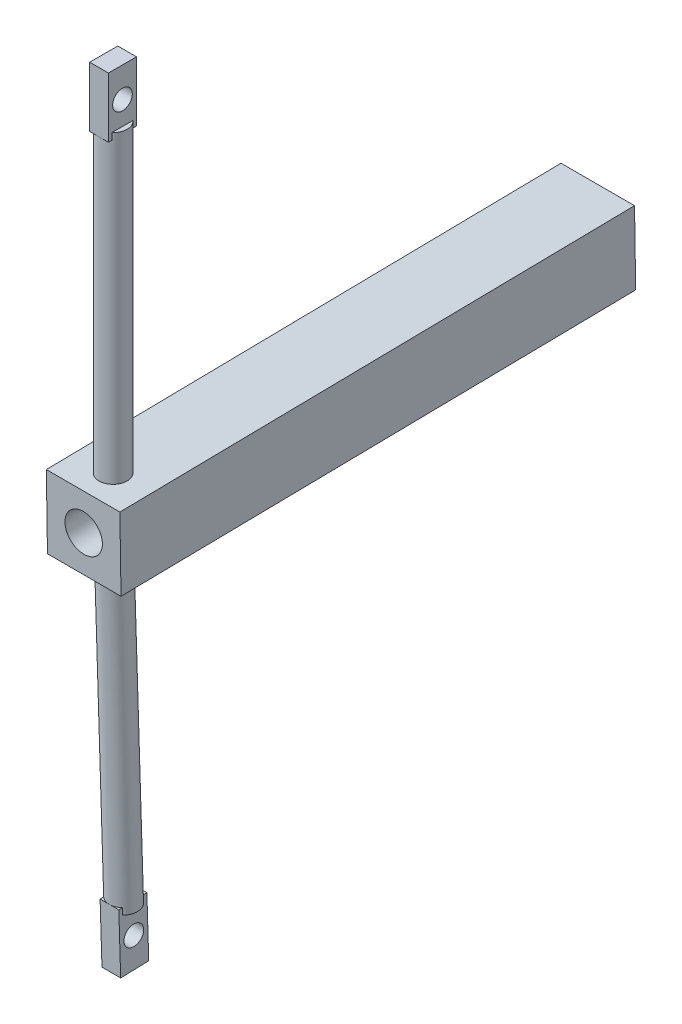
ISO-10303-21;
HEADER;
FILE_DESCRIPTION(('STEP AP214'),'2;1');
FILE_NAME('part.step','',(''),(''),'','','');
FILE_SCHEMA(('AUTOMOTIVE_DESIGN { 1 0 10303 214 1 1 1 1 }'));
ENDSEC;
DATA;
#1=APPLICATION_CONTEXT('core data for automotive mechanical design processes');
#2=APPLICATION_PROTOCOL_DEFINITION('international standard','automotive_design',2000,#1);
#3=PRODUCT_CONTEXT('',#1,'mechanical');
#4=PRODUCT('Part','Part','',(#3));
#5=PRODUCT_RELATED_PRODUCT_CATEGORY('part','',(#4));
#6=PRODUCT_DEFINITION_FORMATION('','',#4);
#7=PRODUCT_DEFINITION_CONTEXT('part definition',#1,'design');
#8=PRODUCT_DEFINITION('design','',#6,#7);
#9=PRODUCT_DEFINITION_SHAPE('','',#8);
#10=(LENGTH_UNIT() NAMED_UNIT(*) SI_UNIT(.MILLI.,.METRE.));
#11=(NAMED_UNIT(*) PLANE_ANGLE_UNIT() SI_UNIT($,.RADIAN.));
#12=(NAMED_UNIT(*) SI_UNIT($,.STERADIAN.) SOLID_ANGLE_UNIT());
#13=UNCERTAINTY_MEASURE_WITH_UNIT(LENGTH_MEASURE(1.E-05),#10,'distance_accuracy_value','');
#14=(GEOMETRIC_REPRESENTATION_CONTEXT(3) GLOBAL_UNCERTAINTY_ASSIGNED_CONTEXT((#13)) GLOBAL_UNIT_ASSIGNED_CONTEXT((#10,
#11,#12)) REPRESENTATION_CONTEXT('',''));
#15=CARTESIAN_POINT('',(0.,0.,0.));
#16=DIRECTION('',(0.,0.,1.));
#17=DIRECTION('',(1.,0.,0.));
#18=AXIS2_PLACEMENT_3D('',#15,#16,#17);
#19=CARTESIAN_POINT('',(-23373.046987515,33277.3926727913,41772.9381892933));
#20=DIRECTION('',(0.,0.999519324513116,0.0310019342113486));
#21=DIRECTION('',(0.,0.0310019342113486,-0.999519324513116));
#22=AXIS2_PLACEMENT_3D('',#19,#20,#21);
#23=PLANE('',#22);
#24=DIRECTION('',(0.,-0.0310019342113486,0.999519324513116));
#25=VECTOR('',#24,1.);
#26=CARTESIAN_POINT('',(-23363.0469875194,33277.3926727913,41772.9381892933));
#27=LINE('',#26,#25);
#28=CARTESIAN_POINT('',(-23363.0469875194,33277.7392849531,41761.7632235172));
#29=VERTEX_POINT('',#28);
#30=CARTESIAN_POINT('',(-23363.0469875194,33277.0460606296,41784.1131550695));
#31=VERTEX_POINT('',#30);
#32=EDGE_CURVE('E268',#29,#31,#27,.T.);
#33=ORIENTED_EDGE('',*,*,#32,.F.);
#34=CARTESIAN_POINT('',(-23373.046987515,33277.3926727913,41772.9381892933));
#35=DIRECTION('',(0.,-0.999519324513116,-0.0310019342113486));
#36=DIRECTION('',(0.,0.0310019342113486,-0.999519324513116));
#37=AXIS2_PLACEMENT_3D('',#34,#35,#36);
#38=CIRCLE('',#37,15.0000000000006);
#39=EDGE_CURVE('E271',#31,#29,#38,.F.);
#40=ORIENTED_EDGE('',*,*,#39,.F.);
#41=EDGE_LOOP('',(#33,#40));
#42=FACE_BOUND('',#41,.T.);
#43=ADVANCED_FACE('F49',(#42),#23,.F.);
#44=CARTESIAN_POINT('',(-23373.046987515,33277.3926727913,41772.9381892933));
#45=DIRECTION('',(0.,0.999519324513116,0.0310019342113486));
#46=DIRECTION('',(0.,-0.0310019342113486,0.999519324513116));
#47=AXIS2_PLACEMENT_3D('',#44,#45,#46);
#48=CYLINDRICAL_SURFACE('',#47,15.0000000000006);
#49=CARTESIAN_POINT('',(-23373.046987515,33602.7741051068,41783.0304941751));
#50=DIRECTION('',(0.,-0.999519324513116,-0.0310019342113486));
#51=DIRECTION('',(0.,0.0310019342113486,-0.999519324513116));
#52=AXIS2_PLACEMENT_3D('',#49,#50,#51);
#53=CIRCLE('',#52,15.0000000000006);
#54=CARTESIAN_POINT('',(-23388.046987515,33602.7741051068,41783.0304941779));
#55=VERTEX_POINT('',#54);
#56=CARTESIAN_POINT('',(-23358.046987515,33602.7741051068,41783.0304941779));
#57=VERTEX_POINT('',#56);
#58=EDGE_CURVE('E274',#55,#57,#53,.F.);
#59=ORIENTED_EDGE('',*,*,#58,.F.);
#60=CARTESIAN_POINT('',(-23373.046987515,33602.7741051068,41783.0304941751));
#61=DIRECTION('',(0.,-0.999879823907132,-0.0155028301752332));
#62=DIRECTION('',(0.,-0.0155028301752332,0.999879823907132));
#63=AXIS2_PLACEMENT_3D('',#60,#61,#62);
#64=ELLIPSE('',#63,15.001802858054,15.0000000000006);
#65=EDGE_CURVE('E393',#55,#57,#64,.T.);
#66=ORIENTED_EDGE('',*,*,#65,.T.);
#67=EDGE_LOOP('',(#59,#66));
#68=FACE_BOUND('',#67,.T.);
#69=CARTESIAN_POINT('',(-23373.046987515,33284.426358658,41773.1563520253));
#70=DIRECTION('',(0.,-0.999519324513116,-0.0310019342113486));
#71=DIRECTION('',(0.,0.0310019342113486,-0.999519324513116));
#72=AXIS2_PLACEMENT_3D('',#69,#70,#71);
#73=CIRCLE('',#72,15.0000000000006);
#74=CARTESIAN_POINT('',(-23373.046987515,33283.9613296449,41788.149141893));
#75=VERTEX_POINT('',#74);
#76=CARTESIAN_POINT('',(-23363.0469875194,33284.0797464963,41784.3313178015));
#77=VERTEX_POINT('',#76);
#78=EDGE_CURVE('E57',#75,#77,#73,.F.);
#79=ORIENTED_EDGE('',*,*,#78,.T.);
#80=DIRECTION('',(0.,0.999519324513116,0.0310019342113486));
#81=VECTOR('',#80,1.);
#82=CARTESIAN_POINT('',(-23363.0469875194,33277.0460606296,41784.1131550695));
#83=LINE('',#82,#81);
#84=EDGE_CURVE('E12',#77,#31,#83,.F.);
#85=ORIENTED_EDGE('',*,*,#84,.T.);
#86=ORIENTED_EDGE('',*,*,#39,.T.);
#87=DIRECTION('',(0.,0.999519324513116,0.0310019342113486));
#88=VECTOR('',#87,1.);
#89=CARTESIAN_POINT('',(-23363.0469875194,33277.7392849531,41761.7632235172));
#90=LINE('',#89,#88);
#91=CARTESIAN_POINT('',(-23363.0469875194,33284.7729708198,41761.9813862492));
#92=VERTEX_POINT('',#91);
#93=EDGE_CURVE('E69',#29,#92,#90,.T.);
#94=ORIENTED_EDGE('',*,*,#93,.T.);
#95=CARTESIAN_POINT('',(-23373.046987515,33284.8913876712,41758.1635621576));
#96=VERTEX_POINT('',#95);
#97=EDGE_CURVE('E405',#92,#96,#73,.F.);
#98=ORIENTED_EDGE('',*,*,#97,.T.);
#99=CARTESIAN_POINT('',(-23383.0469875194,33284.7729708196,41761.9813862571));
#100=VERTEX_POINT('',#99);
#101=EDGE_CURVE('E402',#96,#100,#73,.F.);
#102=ORIENTED_EDGE('',*,*,#101,.T.);
#103=DIRECTION('',(0.,0.999519324513116,0.0310019342113486));
#104=VECTOR('',#103,1.);
#105=CARTESIAN_POINT('',(-23383.0469875194,33277.7392849529,41761.7632235251));
#106=LINE('',#105,#104);
#107=CARTESIAN_POINT('',(-23383.0469875194,33277.7392849529,41761.7632235251));
#108=VERTEX_POINT('',#107);
#109=EDGE_CURVE('E399',#108,#100,#106,.T.);
#110=ORIENTED_EDGE('',*,*,#109,.F.);
#111=CARTESIAN_POINT('',(-23383.0469875194,33277.0460606298,41784.1131550616));
#112=VERTEX_POINT('',#111);
#113=EDGE_CURVE('E273',#108,#112,#38,.F.);
#114=ORIENTED_EDGE('',*,*,#113,.T.);
#115=DIRECTION('',(0.,0.999519324513116,0.0310019342113486));
#116=VECTOR('',#115,1.);
#117=CARTESIAN_POINT('',(-23383.0469875194,33277.0460606298,41784.1131550616));
#118=LINE('',#117,#116);
#119=CARTESIAN_POINT('',(-23383.0469875194,33284.0797464965,41784.3313177936));
#120=VERTEX_POINT('',#119);
#121=EDGE_CURVE('E404',#120,#112,#118,.F.);
#122=ORIENTED_EDGE('',*,*,#121,.F.);
#123=EDGE_CURVE('E226',#120,#75,#73,.F.);
#124=ORIENTED_EDGE('',*,*,#123,.T.);
#125=EDGE_LOOP('',(#79,#85,#86,#94,#98,#102,#110,#114,#122,#124));
#126=FACE_BOUND('',#125,.T.);
#127=ADVANCED_FACE('F407',(#68,#126),#48,.T.);
#128=CARTESIAN_POINT('',(-23373.046987515,34006.8953400424,41784.2489045337));
#129=DIRECTION('',(0.,-1.,0.));
#130=DIRECTION('',(0.,0.,-1.));
#131=AXIS2_PLACEMENT_3D('',#128,#129,#130);
#132=PLANE('',#131);
#133=DIRECTION('',(0.,0.,-1.));
#134=VECTOR('',#133,1.);
#135=CARTESIAN_POINT('',(-23363.0469875194,34006.8953400424,41784.2489045337));
#136=LINE('',#135,#134);
#137=CARTESIAN_POINT('',(-23363.0469875194,34006.8953400424,41795.4292444251));
#138=VERTEX_POINT('',#137);
#139=CARTESIAN_POINT('',(-23363.0469875194,34006.8953400424,41773.0685646422));
#140=VERTEX_POINT('',#139);
#141=EDGE_CURVE('E323',#138,#140,#136,.T.);
#142=ORIENTED_EDGE('',*,*,#141,.F.);
#143=CARTESIAN_POINT('',(-23373.046987515,34006.8953400424,41784.2489045337));
#144=DIRECTION('',(0.,-1.,0.));
#145=DIRECTION('',(0.,0.,-1.));
#146=AXIS2_PLACEMENT_3D('',#143,#144,#145);
#147=CIRCLE('',#146,15.0000000000006);
#148=EDGE_CURVE('E329',#140,#138,#147,.T.);
#149=ORIENTED_EDGE('',*,*,#148,.F.);
#150=EDGE_LOOP('',(#142,#149));
#151=FACE_BOUND('',#150,.T.);
#152=ADVANCED_FACE('F423',(#151),#132,.F.);
#153=CARTESIAN_POINT('',(-23373.046987515,34006.8953400424,41784.2489045337));
#154=DIRECTION('',(0.,-1.,0.));
#155=DIRECTION('',(0.,0.,-1.));
#156=AXIS2_PLACEMENT_3D('',#153,#154,#155);
#157=CYLINDRICAL_SURFACE('',#156,15.0000000000006);
#158=CARTESIAN_POINT('',(-23373.046987515,33999.8582716294,41784.2489045337));
#159=DIRECTION('',(0.,-1.,0.));
#160=DIRECTION('',(1.,0.,0.));
#161=AXIS2_PLACEMENT_3D('',#158,#159,#160);
#162=CIRCLE('',#161,15.0000000000006);
#163=CARTESIAN_POINT('',(-23373.046987515,33999.8582716294,41799.2489045337));
#164=VERTEX_POINT('',#163);
#165=CARTESIAN_POINT('',(-23363.0469875194,33999.8582716294,41795.4292444251));
#166=VERTEX_POINT('',#165);
#167=EDGE_CURVE('E384',#164,#166,#162,.F.);
#168=ORIENTED_EDGE('',*,*,#167,.F.);
#169=CARTESIAN_POINT('',(-23383.0469875194,33999.8582716294,41795.4292444172));
#170=VERTEX_POINT('',#169);
#171=EDGE_CURVE('E380',#170,#164,#162,.F.);
#172=ORIENTED_EDGE('',*,*,#171,.F.);
#173=DIRECTION('',(0.,-1.,0.));
#174=VECTOR('',#173,1.);
#175=CARTESIAN_POINT('',(-23383.0469875194,34006.8953400424,41795.4292444172));
#176=LINE('',#175,#174);
#177=CARTESIAN_POINT('',(-23383.0469875194,34006.8953400424,41795.4292444172));
#178=VERTEX_POINT('',#177);
#179=EDGE_CURVE('E377',#178,#170,#176,.T.);
#180=ORIENTED_EDGE('',*,*,#179,.F.);
#181=CARTESIAN_POINT('',(-23383.0469875194,34006.8953400424,41773.0685646501));
#182=VERTEX_POINT('',#181);
#183=EDGE_CURVE('E326',#178,#182,#147,.T.);
#184=ORIENTED_EDGE('',*,*,#183,.T.);
#185=DIRECTION('',(0.,-1.,0.));
#186=VECTOR('',#185,1.);
#187=CARTESIAN_POINT('',(-23383.0469875194,34006.8953400424,41773.0685646501));
#188=LINE('',#187,#186);
#189=CARTESIAN_POINT('',(-23383.0469875194,33999.8582716294,41773.0685646501));
#190=VERTEX_POINT('',#189);
#191=EDGE_CURVE('E383',#190,#182,#188,.F.);
#192=ORIENTED_EDGE('',*,*,#191,.F.);
#193=CARTESIAN_POINT('',(-23373.046987515,33999.8582716294,41769.2489045337));
#194=VERTEX_POINT('',#193);
#195=EDGE_CURVE('E385',#194,#190,#162,.F.);
#196=ORIENTED_EDGE('',*,*,#195,.F.);
#197=CARTESIAN_POINT('',(-23363.0469875194,33999.8582716294,41773.0685646422));
#198=VERTEX_POINT('',#197);
#199=EDGE_CURVE('E391',#198,#194,#162,.F.);
#200=ORIENTED_EDGE('',*,*,#199,.F.);
#201=DIRECTION('',(0.,-1.,0.));
#202=VECTOR('',#201,1.);
#203=CARTESIAN_POINT('',(-23363.0469875194,34006.8953400424,41773.0685646422));
#204=LINE('',#203,#202);
#205=EDGE_CURVE('E388',#198,#140,#204,.F.);
#206=ORIENTED_EDGE('',*,*,#205,.T.);
#207=ORIENTED_EDGE('',*,*,#148,.T.);
#208=DIRECTION('',(0.,-1.,0.));
#209=VECTOR('',#208,1.);
#210=CARTESIAN_POINT('',(-23363.0469875194,34006.8953400424,41795.4292444251));
#211=LINE('',#210,#209);
#212=EDGE_CURVE('E390',#138,#166,#211,.T.);
#213=ORIENTED_EDGE('',*,*,#212,.T.);
#214=EDGE_LOOP('',(#168,#172,#180,#184,#192,#196,#200,#206,#207,#213));
#215=FACE_BOUND('',#214,.T.);
#216=CARTESIAN_POINT('',(-23373.046987515,33681.3574296333,41784.2489045337));
#217=DIRECTION('',(0.,-1.,0.));
#218=DIRECTION('',(0.,0.,-1.));
#219=AXIS2_PLACEMENT_3D('',#216,#217,#218);
#220=CIRCLE('',#219,15.0000000000006);
#221=CARTESIAN_POINT('',(-23358.046987515,33681.3574296333,41784.2489045318));
#222=VERTEX_POINT('',#221);
#223=CARTESIAN_POINT('',(-23388.046987515,33681.3574296333,41784.2489045318));
#224=VERTEX_POINT('',#223);
#225=EDGE_CURVE('E330',#222,#224,#220,.T.);
#226=ORIENTED_EDGE('',*,*,#225,.F.);
#227=CARTESIAN_POINT('',(-23373.046987515,33681.3574296333,41784.2489045337));
#228=DIRECTION('',(0.,0.999879823907132,0.0155028301752332));
#229=DIRECTION('',(0.,-0.0155028301752332,0.999879823907132));
#230=AXIS2_PLACEMENT_3D('',#227,#228,#229);
#231=ELLIPSE('',#230,15.001802858054,15.0000000000006);
#232=EDGE_CURVE('E366',#222,#224,#231,.T.);
#233=ORIENTED_EDGE('',*,*,#232,.T.);
#234=EDGE_LOOP('',(#226,#233));
#235=FACE_BOUND('',#234,.T.);
#236=ADVANCED_FACE('F704',(#215,#235),#157,.T.);
#237=CARTESIAN_POINT('',(-23412.3433722642,33689.3868775884,41266.3768181689));
#238=DIRECTION('',(-1.,0.,1.08392396066358E-13));
#239=DIRECTION('',(1.08392396066358E-13,0.,1.));
#240=AXIS2_PLACEMENT_3D('',#237,#238,#239);
#241=PLANE('',#240);
#242=DIRECTION('',(0.,-0.999879823907133,-0.0155028301751942));
#243=VECTOR('',#242,1.);
#244=CARTESIAN_POINT('',(-23412.3433722641,33680.860320992,41816.3107213178));
#245=LINE('',#244,#243);
#246=CARTESIAN_POINT('',(-23412.3433722641,33680.860320992,41816.3107213178));
#247=VERTEX_POINT('',#246);
#248=CARTESIAN_POINT('',(-23412.3433722641,33602.2769964655,41815.0923109593));
#249=VERTEX_POINT('',#248);
#250=EDGE_CURVE('E337',#247,#249,#245,.T.);
#251=ORIENTED_EDGE('',*,*,#250,.F.);
#252=DIRECTION('',(1.08405423806636E-13,-0.0155028301752332,0.999879823907132));
#253=VECTOR('',#252,1.);
#254=CARTESIAN_POINT('',(-23412.3433722642,33689.3868775884,41266.3768181689));
#255=LINE('',#254,#253);
#256=CARTESIAN_POINT('',(-23412.3433722642,33689.3868775884,41266.3768181689));
#257=VERTEX_POINT('',#256);
#258=EDGE_CURVE('E364',#257,#247,#255,.T.);
#259=ORIENTED_EDGE('',*,*,#258,.F.);
#260=DIRECTION('',(0.,-0.999879823907133,-0.0155028301751942));
#261=VECTOR('',#260,1.);
#262=CARTESIAN_POINT('',(-23412.3433722642,33689.3868775884,41266.3768181689));
#263=LINE('',#262,#261);
#264=CARTESIAN_POINT('',(-23412.3433722642,33610.8035530619,41265.1584078104));
#265=VERTEX_POINT('',#264);
#266=EDGE_CURVE('E340',#257,#265,#263,.T.);
#267=ORIENTED_EDGE('',*,*,#266,.T.);
#268=DIRECTION('',(1.08405423806636E-13,-0.0155028301752332,0.999879823907132));
#269=VECTOR('',#268,1.);
#270=CARTESIAN_POINT('',(-23412.3433722642,33610.8035530619,41265.1584078104));
#271=LINE('',#270,#269);
#272=EDGE_CURVE('E353',#265,#249,#271,.T.);
#273=ORIENTED_EDGE('',*,*,#272,.T.);
#274=EDGE_LOOP('',(#251,#259,#267,#273));
#275=FACE_BOUND('',#274,.T.);
#276=ADVANCED_FACE('F51',(#275),#241,.T.);
#277=CARTESIAN_POINT('',(-23333.7506027658,33689.3868775884,41266.3768181689));
#278=DIRECTION('',(0.,0.999879823907132,0.0155028301752332));
#279=DIRECTION('',(0.,-0.0155028301752332,0.999879823907132));
#280=AXIS2_PLACEMENT_3D('',#277,#278,#279);
#281=PLANE('',#280);
#282=DIRECTION('',(1.,0.,0.));
#283=VECTOR('',#282,1.);
#284=CARTESIAN_POINT('',(-23333.7506027657,33681.3574296333,41784.2489045318));
#285=LINE('',#284,#283);
#286=EDGE_CURVE('E374',#224,#222,#285,.T.);
#287=ORIENTED_EDGE('',*,*,#286,.F.);
#288=ORIENTED_EDGE('',*,*,#232,.F.);
#289=EDGE_LOOP('',(#287,#288));
#290=FACE_BOUND('',#289,.T.);
#291=DIRECTION('',(-1.,0.,0.));
#292=VECTOR('',#291,1.);
#293=CARTESIAN_POINT('',(-23333.7506027657,33680.860320992,41816.3107213178));
#294=LINE('',#293,#292);
#295=CARTESIAN_POINT('',(-23333.7506027657,33680.860320992,41816.3107213178));
#296=VERTEX_POINT('',#295);
#297=EDGE_CURVE('E344',#296,#247,#294,.T.);
#298=ORIENTED_EDGE('',*,*,#297,.F.);
#299=DIRECTION('',(1.08405423806636E-13,-0.0155028301752332,0.999879823907132));
#300=VECTOR('',#299,1.);
#301=CARTESIAN_POINT('',(-23333.7506027658,33689.3868775884,41266.3768181689));
#302=LINE('',#301,#300);
#303=CARTESIAN_POINT('',(-23333.7506027658,33689.3868775884,41266.3768181689));
#304=VERTEX_POINT('',#303);
#305=EDGE_CURVE('E367',#304,#296,#302,.T.);
#306=ORIENTED_EDGE('',*,*,#305,.F.);
#307=DIRECTION('',(-1.,0.,0.));
#308=VECTOR('',#307,1.);
#309=CARTESIAN_POINT('',(-23333.7506027658,33689.3868775884,41266.3768181689));
#310=LINE('',#309,#308);
#311=EDGE_CURVE('E350',#304,#257,#310,.T.);
#312=ORIENTED_EDGE('',*,*,#311,.T.);
#313=ORIENTED_EDGE('',*,*,#258,.T.);
#314=EDGE_LOOP('',(#298,#306,#312,#313));
#315=FACE_BOUND('',#314,.T.);
#316=ADVANCED_FACE('F730',(#290,#315),#281,.T.);
#317=CARTESIAN_POINT('',(-23333.7506027658,33689.3868775884,41266.3768181689));
#318=DIRECTION('',(1.,0.,-1.08392396066358E-13));
#319=DIRECTION('',(-1.08392396066358E-13,0.,-1.));
#320=AXIS2_PLACEMENT_3D('',#317,#318,#319);
#321=PLANE('',#320);
#322=DIRECTION('',(0.,0.999879823907133,0.0155028301751942));
#323=VECTOR('',#322,1.);
#324=CARTESIAN_POINT('',(-23333.7506027657,33680.860320992,41816.3107213178));
#325=LINE('',#324,#323);
#326=CARTESIAN_POINT('',(-23333.7506027657,33602.2769964655,41815.0923109593));
#327=VERTEX_POINT('',#326);
#328=EDGE_CURVE('E359',#327,#296,#325,.T.);
#329=ORIENTED_EDGE('',*,*,#328,.F.);
#330=DIRECTION('',(1.08405423806636E-13,-0.0155028301752332,0.999879823907132));
#331=VECTOR('',#330,1.);
#332=CARTESIAN_POINT('',(-23333.7506027658,33610.8035530619,41265.1584078104));
#333=LINE('',#332,#331);
#334=CARTESIAN_POINT('',(-23333.7506027658,33610.8035530619,41265.1584078104));
#335=VERTEX_POINT('',#334);
#336=EDGE_CURVE('E369',#335,#327,#333,.T.);
#337=ORIENTED_EDGE('',*,*,#336,.F.);
#338=DIRECTION('',(0.,0.999879823907133,0.0155028301751942));
#339=VECTOR('',#338,1.);
#340=CARTESIAN_POINT('',(-23333.7506027658,33689.3868775884,41266.3768181689));
#341=LINE('',#340,#339);
#342=EDGE_CURVE('E347',#335,#304,#341,.T.);
#343=ORIENTED_EDGE('',*,*,#342,.T.);
#344=ORIENTED_EDGE('',*,*,#305,.T.);
#345=EDGE_LOOP('',(#329,#337,#343,#344));
#346=FACE_BOUND('',#345,.T.);
#347=ADVANCED_FACE('F565',(#346),#321,.T.);
#348=CARTESIAN_POINT('',(-23333.7506027658,33610.8035530619,41265.1584078104));
#349=DIRECTION('',(0.,-0.999879823907132,-0.0155028301752332));
#350=DIRECTION('',(0.,0.0155028301752332,-0.999879823907132));
#351=AXIS2_PLACEMENT_3D('',#348,#349,#350);
#352=PLANE('',#351);
#353=DIRECTION('',(-1.,0.,0.));
#354=VECTOR('',#353,1.);
#355=CARTESIAN_POINT('',(-23333.7506027657,33602.7741051068,41783.030494178));
#356=LINE('',#355,#354);
#357=EDGE_CURVE('E396',#57,#55,#356,.T.);
#358=ORIENTED_EDGE('',*,*,#357,.F.);
#359=ORIENTED_EDGE('',*,*,#65,.F.);
#360=EDGE_LOOP('',(#358,#359));
#361=FACE_BOUND('',#360,.T.);
#362=DIRECTION('',(1.,0.,0.));
#363=VECTOR('',#362,1.);
#364=CARTESIAN_POINT('',(-23333.7506027657,33602.2769964655,41815.0923109593));
#365=LINE('',#364,#363);
#366=EDGE_CURVE('E356',#249,#327,#365,.T.);
#367=ORIENTED_EDGE('',*,*,#366,.F.);
#368=ORIENTED_EDGE('',*,*,#272,.F.);
#369=DIRECTION('',(1.,0.,0.));
#370=VECTOR('',#369,1.);
#371=CARTESIAN_POINT('',(-23333.7506027658,33610.8035530619,41265.1584078104));
#372=LINE('',#371,#370);
#373=EDGE_CURVE('E343',#265,#335,#372,.T.);
#374=ORIENTED_EDGE('',*,*,#373,.T.);
#375=ORIENTED_EDGE('',*,*,#336,.T.);
#376=EDGE_LOOP('',(#367,#368,#374,#375));
#377=FACE_BOUND('',#376,.T.);
#378=ADVANCED_FACE('F559',(#361,#377),#352,.T.);
#379=CARTESIAN_POINT('',(3.67280312631517E-09,-631.571918407068,40734.2408724838));
#380=DIRECTION('',(0.,0.0155028301751942,-0.999879823907133));
#381=DIRECTION('',(0.,0.999879823907133,0.0155028301751942));
#382=AXIS2_PLACEMENT_3D('',#379,#380,#381);
#383=PLANE('',#382);
#384=CARTESIAN_POINT('',(-23373.046987515,33650.0952153251,41265.7676129896));
#385=DIRECTION('',(1.08405423806636E-13,-0.0155028301752332,0.999879823907132));
#386=DIRECTION('',(0.,-0.999879823907132,-0.0155028301752332));
#387=AXIS2_PLACEMENT_3D('',#384,#385,#386);
#388=CIRCLE('',#387,20.0000000000028);
#389=CARTESIAN_POINT('',(-23373.046987515,33630.097618847,41265.4575563861));
#390=VERTEX_POINT('',#389);
#391=EDGE_CURVE('E334',#390,#390,#388,.T.);
#392=ORIENTED_EDGE('',*,*,#391,.T.);
#393=EDGE_LOOP('',(#392));
#394=FACE_BOUND('',#393,.T.);
#395=ORIENTED_EDGE('',*,*,#266,.F.);
#396=ORIENTED_EDGE('',*,*,#311,.F.);
#397=ORIENTED_EDGE('',*,*,#342,.F.);
#398=ORIENTED_EDGE('',*,*,#373,.F.);
#399=EDGE_LOOP('',(#395,#396,#397,#398));
#400=FACE_BOUND('',#399,.T.);
#401=ADVANCED_FACE('F564',(#394,#400),#383,.T.);
#402=CARTESIAN_POINT('',(3.73242610940882E-09,-640.098475003446,41284.1747756327));
#403=DIRECTION('',(0.,0.0155028301751942,-0.999879823907133));
#404=DIRECTION('',(0.,0.999879823907133,0.0155028301751942));
#405=AXIS2_PLACEMENT_3D('',#402,#403,#404);
#406=PLANE('',#405);
#407=CARTESIAN_POINT('',(-23373.0469875149,33641.5686587287,41815.7015161386));
#408=DIRECTION('',(1.08405423806636E-13,-0.0155028301752332,0.999879823907132));
#409=DIRECTION('',(0.,-0.999879823907132,-0.0155028301752332));
#410=AXIS2_PLACEMENT_3D('',#407,#408,#409);
#411=CIRCLE('',#410,20.0000000000028);
#412=CARTESIAN_POINT('',(-23373.0469875149,33621.5710622506,41815.3914595351));
#413=VERTEX_POINT('',#412);
#414=EDGE_CURVE('E333',#413,#413,#411,.T.);
#415=ORIENTED_EDGE('',*,*,#414,.F.);
#416=EDGE_LOOP('',(#415));
#417=FACE_BOUND('',#416,.T.);
#418=ORIENTED_EDGE('',*,*,#250,.T.);
#419=ORIENTED_EDGE('',*,*,#366,.T.);
#420=ORIENTED_EDGE('',*,*,#328,.T.);
#421=ORIENTED_EDGE('',*,*,#297,.T.);
#422=EDGE_LOOP('',(#418,#419,#420,#421));
#423=FACE_BOUND('',#422,.T.);
#424=ADVANCED_FACE('F744',(#417,#423),#406,.F.);
#425=CARTESIAN_POINT('',(-23373.046987515,33650.0952153251,41265.7676129896));
#426=DIRECTION('',(1.08405423806636E-13,-0.0155028301752332,0.999879823907132));
#427=DIRECTION('',(0.,-0.999879823907132,-0.0155028301752332));
#428=AXIS2_PLACEMENT_3D('',#425,#426,#427);
#429=CYLINDRICAL_SURFACE('',#428,20.0000000000028);
#430=ORIENTED_EDGE('',*,*,#391,.F.);
#431=EDGE_LOOP('',(#430));
#432=FACE_BOUND('',#431,.T.);
#433=ORIENTED_EDGE('',*,*,#414,.T.);
#434=EDGE_LOOP('',(#433));
#435=FACE_BOUND('',#434,.T.);
#436=ADVANCED_FACE('F694',(#432,#435),#429,.F.);
#437=ORIENTED_EDGE('',*,*,#183,.F.);
#438=DIRECTION('',(0.,0.,-1.));
#439=VECTOR('',#438,1.);
#440=CARTESIAN_POINT('',(-23383.0469875194,34006.8953400424,41784.2489045337));
#441=LINE('',#440,#439);
#442=EDGE_CURVE('E313',#178,#182,#441,.T.);
#443=ORIENTED_EDGE('',*,*,#442,.T.);
#444=EDGE_LOOP('',(#437,#443));
#445=FACE_BOUND('',#444,.T.);
#446=ADVANCED_FACE('F683',(#445),#132,.F.);
#447=CARTESIAN_POINT('',(-23373.046987515,33681.3574296333,41784.2489045337));
#448=DIRECTION('',(0.,-1.,0.));
#449=DIRECTION('',(0.,0.,-1.));
#450=AXIS2_PLACEMENT_3D('',#447,#448,#449);
#451=PLANE('',#450);
#452=ORIENTED_EDGE('',*,*,#225,.T.);
#453=ORIENTED_EDGE('',*,*,#286,.T.);
#454=EDGE_LOOP('',(#452,#453));
#455=FACE_BOUND('',#454,.T.);
#456=ADVANCED_FACE('F681',(#455),#451,.T.);
#457=CARTESIAN_POINT('',(-23363.0469875194,33999.8582716294,41769.2489045337));
#458=DIRECTION('',(0.,-1.,0.));
#459=DIRECTION('',(1.,0.,0.));
#460=AXIS2_PLACEMENT_3D('',#457,#458,#459);
#461=PLANE('',#460);
#462=DIRECTION('',(0.,0.,1.));
#463=VECTOR('',#462,1.);
#464=CARTESIAN_POINT('',(-23363.0469875194,33999.8582716294,41769.2489045337));
#465=LINE('',#464,#463);
#466=CARTESIAN_POINT('',(-23363.0469875194,33999.8582716294,41769.2489045337));
#467=VERTEX_POINT('',#466);
#468=EDGE_CURVE('E306',#467,#198,#465,.T.);
#469=ORIENTED_EDGE('',*,*,#468,.T.);
#470=ORIENTED_EDGE('',*,*,#199,.T.);
#471=DIRECTION('',(-1.,0.,0.));
#472=VECTOR('',#471,1.);
#473=CARTESIAN_POINT('',(-23363.0469875194,33999.8582716294,41769.2489045337));
#474=LINE('',#473,#472);
#475=EDGE_CURVE('E315',#467,#194,#474,.T.);
#476=ORIENTED_EDGE('',*,*,#475,.F.);
#477=EDGE_LOOP('',(#469,#470,#476));
#478=FACE_BOUND('',#477,.T.);
#479=ADVANCED_FACE('F642',(#478),#461,.T.);
#480=CARTESIAN_POINT('',(-23383.0469875194,33999.8582716294,41769.2489045337));
#481=VERTEX_POINT('',#480);
#482=EDGE_CURVE('E318',#194,#481,#474,.T.);
#483=ORIENTED_EDGE('',*,*,#482,.F.);
#484=ORIENTED_EDGE('',*,*,#195,.T.);
#485=DIRECTION('',(0.,0.,1.));
#486=VECTOR('',#485,1.);
#487=CARTESIAN_POINT('',(-23383.0469875194,33999.8582716294,41769.2489045337));
#488=LINE('',#487,#486);
#489=EDGE_CURVE('E290',#481,#190,#488,.T.);
#490=ORIENTED_EDGE('',*,*,#489,.F.);
#491=EDGE_LOOP('',(#483,#484,#490));
#492=FACE_BOUND('',#491,.T.);
#493=ADVANCED_FACE('F662',(#492),#461,.T.);
#494=CARTESIAN_POINT('',(-23383.0469875194,33999.8582716294,41799.2489045337));
#495=VERTEX_POINT('',#494);
#496=EDGE_CURVE('E289',#170,#495,#488,.T.);
#497=ORIENTED_EDGE('',*,*,#496,.F.);
#498=ORIENTED_EDGE('',*,*,#171,.T.);
#499=DIRECTION('',(-1.,0.,0.));
#500=VECTOR('',#499,1.);
#501=CARTESIAN_POINT('',(-23363.0469875194,33999.8582716294,41799.2489045337));
#502=LINE('',#501,#500);
#503=EDGE_CURVE('E314',#164,#495,#502,.T.);
#504=ORIENTED_EDGE('',*,*,#503,.T.);
#505=EDGE_LOOP('',(#497,#498,#504));
#506=FACE_BOUND('',#505,.T.);
#507=ADVANCED_FACE('F643',(#506),#461,.T.);
#508=CARTESIAN_POINT('',(-23363.0469875194,34063.9324084283,41799.2489045337));
#509=DIRECTION('',(0.,0.,1.));
#510=DIRECTION('',(1.,0.,0.));
#511=AXIS2_PLACEMENT_3D('',#508,#509,#510);
#512=PLANE('',#511);
#513=DIRECTION('',(-1.,0.,0.));
#514=VECTOR('',#513,1.);
#515=CARTESIAN_POINT('',(-23363.0469875194,34063.9324084283,41799.2489045337));
#516=LINE('',#515,#514);
#517=CARTESIAN_POINT('',(-23363.0469875194,34063.9324084283,41799.2489045337));
#518=VERTEX_POINT('',#517);
#519=CARTESIAN_POINT('',(-23383.0469875194,34063.9324084283,41799.2489045337));
#520=VERTEX_POINT('',#519);
#521=EDGE_CURVE('E309',#518,#520,#516,.T.);
#522=ORIENTED_EDGE('',*,*,#521,.T.);
#523=DIRECTION('',(0.,1.,0.));
#524=VECTOR('',#523,1.);
#525=CARTESIAN_POINT('',(-23383.0469875194,34063.9324084283,41799.2489045337));
#526=LINE('',#525,#524);
#527=EDGE_CURVE('E280',#495,#520,#526,.T.);
#528=ORIENTED_EDGE('',*,*,#527,.F.);
#529=ORIENTED_EDGE('',*,*,#503,.F.);
#530=CARTESIAN_POINT('',(-23363.0469875194,33999.8582716294,41799.2489045337));
#531=VERTEX_POINT('',#530);
#532=EDGE_CURVE('E310',#531,#164,#502,.T.);
#533=ORIENTED_EDGE('',*,*,#532,.F.);
#534=DIRECTION('',(0.,1.,0.));
#535=VECTOR('',#534,1.);
#536=CARTESIAN_POINT('',(-23363.0469875194,34063.9324084283,41799.2489045337));
#537=LINE('',#536,#535);
#538=EDGE_CURVE('E296',#531,#518,#537,.T.);
#539=ORIENTED_EDGE('',*,*,#538,.T.);
#540=EDGE_LOOP('',(#522,#528,#529,#533,#539));
#541=FACE_BOUND('',#540,.T.);
#542=ADVANCED_FACE('F639',(#541),#512,.T.);
#543=ORIENTED_EDGE('',*,*,#532,.T.);
#544=ORIENTED_EDGE('',*,*,#167,.T.);
#545=EDGE_CURVE('E305',#166,#531,#465,.T.);
#546=ORIENTED_EDGE('',*,*,#545,.T.);
#547=EDGE_LOOP('',(#543,#544,#546));
#548=FACE_BOUND('',#547,.T.);
#549=ADVANCED_FACE('F628',(#548),#461,.T.);
#550=CARTESIAN_POINT('',(-23363.0469875194,34063.9324084283,41769.248904559));
#551=DIRECTION('',(0.,3.94782086139484E-10,-1.));
#552=DIRECTION('',(0.,1.,3.94782086139484E-10));
#553=AXIS2_PLACEMENT_3D('',#550,#551,#552);
#554=PLANE('',#553);
#555=ORIENTED_EDGE('',*,*,#475,.T.);
#556=ORIENTED_EDGE('',*,*,#482,.T.);
#557=DIRECTION('',(0.,-1.,-3.94782086139484E-10));
#558=VECTOR('',#557,1.);
#559=CARTESIAN_POINT('',(-23383.0469875194,34063.9324084283,41769.248904559));
#560=LINE('',#559,#558);
#561=CARTESIAN_POINT('',(-23383.0469875194,34063.9324084283,41769.248904559));
#562=VERTEX_POINT('',#561);
#563=EDGE_CURVE('E286',#562,#481,#560,.T.);
#564=ORIENTED_EDGE('',*,*,#563,.F.);
#565=DIRECTION('',(-1.,0.,0.));
#566=VECTOR('',#565,1.);
#567=CARTESIAN_POINT('',(-23363.0469875194,34063.9324084283,41769.248904559));
#568=LINE('',#567,#566);
#569=CARTESIAN_POINT('',(-23363.0469875194,34063.9324084283,41769.248904559));
#570=VERTEX_POINT('',#569);
#571=EDGE_CURVE('E319',#570,#562,#568,.T.);
#572=ORIENTED_EDGE('',*,*,#571,.F.);
#573=DIRECTION('',(0.,-1.,-3.94782086139484E-10));
#574=VECTOR('',#573,1.);
#575=CARTESIAN_POINT('',(-23363.0469875194,34063.9324084283,41769.248904559));
#576=LINE('',#575,#574);
#577=EDGE_CURVE('E302',#570,#467,#576,.T.);
#578=ORIENTED_EDGE('',*,*,#577,.T.);
#579=EDGE_LOOP('',(#555,#556,#564,#572,#578));
#580=FACE_BOUND('',#579,.T.);
#581=ADVANCED_FACE('F617',(#580),#554,.T.);
#582=CARTESIAN_POINT('',(-23363.0469875194,34063.9324084283,41769.248904559));
#583=DIRECTION('',(0.,1.,0.));
#584=DIRECTION('',(-1.,0.,0.));
#585=AXIS2_PLACEMENT_3D('',#582,#583,#584);
#586=PLANE('',#585);
#587=ORIENTED_EDGE('',*,*,#571,.T.);
#588=DIRECTION('',(0.,0.,-1.));
#589=VECTOR('',#588,1.);
#590=CARTESIAN_POINT('',(-23383.0469875194,34063.9324084283,41769.248904559));
#591=LINE('',#590,#589);
#592=EDGE_CURVE('E283',#520,#562,#591,.T.);
#593=ORIENTED_EDGE('',*,*,#592,.F.);
#594=ORIENTED_EDGE('',*,*,#521,.F.);
#595=DIRECTION('',(0.,0.,-1.));
#596=VECTOR('',#595,1.);
#597=CARTESIAN_POINT('',(-23363.0469875194,34063.9324084283,41769.248904559));
#598=LINE('',#597,#596);
#599=EDGE_CURVE('E299',#518,#570,#598,.T.);
#600=ORIENTED_EDGE('',*,*,#599,.T.);
#601=EDGE_LOOP('',(#587,#593,#594,#600));
#602=FACE_BOUND('',#601,.T.);
#603=ADVANCED_FACE('F606',(#602),#586,.T.);
#604=CARTESIAN_POINT('',(-23363.0469875194,0.,0.));
#605=DIRECTION('',(-1.,0.,0.));
#606=DIRECTION('',(0.,0.,1.));
#607=AXIS2_PLACEMENT_3D('',#604,#605,#606);
#608=PLANE('',#607);
#609=ORIENTED_EDGE('',*,*,#205,.F.);
#610=ORIENTED_EDGE('',*,*,#468,.F.);
#611=ORIENTED_EDGE('',*,*,#577,.F.);
#612=ORIENTED_EDGE('',*,*,#599,.F.);
#613=ORIENTED_EDGE('',*,*,#538,.F.);
#614=ORIENTED_EDGE('',*,*,#545,.F.);
#615=ORIENTED_EDGE('',*,*,#212,.F.);
#616=ORIENTED_EDGE('',*,*,#141,.T.);
#617=EDGE_LOOP('',(#609,#610,#611,#612,#613,#614,#615,#616));
#618=FACE_BOUND('',#617,.T.);
#619=CARTESIAN_POINT('',(-23363.0469875194,34031.8953400424,41784.24890454));
#620=DIRECTION('',(-1.,0.,0.));
#621=DIRECTION('',(0.,0.,1.));
#622=AXIS2_PLACEMENT_3D('',#619,#620,#621);
#623=CIRCLE('',#622,10.4999999999991);
#624=CARTESIAN_POINT('',(-23363.0469875194,34031.8953400424,41794.74890454));
#625=VERTEX_POINT('',#624);
#626=EDGE_CURVE('E293',#625,#625,#623,.T.);
#627=ORIENTED_EDGE('',*,*,#626,.T.);
#628=EDGE_LOOP('',(#627));
#629=FACE_BOUND('',#628,.T.);
#630=ADVANCED_FACE('F595',(#618,#629),#608,.F.);
#631=CARTESIAN_POINT('',(-23363.0469875194,34031.8953400424,41784.24890454));
#632=DIRECTION('',(-1.,0.,0.));
#633=DIRECTION('',(0.,0.,1.));
#634=AXIS2_PLACEMENT_3D('',#631,#632,#633);
#635=CYLINDRICAL_SURFACE('',#634,10.4999999999991);
#636=ORIENTED_EDGE('',*,*,#626,.F.);
#637=EDGE_LOOP('',(#636));
#638=FACE_BOUND('',#637,.T.);
#639=CARTESIAN_POINT('',(-23383.0469875194,34031.8953400424,41784.24890454));
#640=DIRECTION('',(-1.,0.,0.));
#641=DIRECTION('',(0.,0.,1.));
#642=AXIS2_PLACEMENT_3D('',#639,#640,#641);
#643=CIRCLE('',#642,10.4999999999991);
#644=CARTESIAN_POINT('',(-23383.0469875194,34031.8953400424,41794.74890454));
#645=VERTEX_POINT('',#644);
#646=EDGE_CURVE('E277',#645,#645,#643,.T.);
#647=ORIENTED_EDGE('',*,*,#646,.T.);
#648=EDGE_LOOP('',(#647));
#649=FACE_BOUND('',#648,.T.);
#650=ADVANCED_FACE('F437',(#638,#649),#635,.F.);
#651=CARTESIAN_POINT('',(-23383.0469875194,0.,0.));
#652=DIRECTION('',(-1.,0.,0.));
#653=DIRECTION('',(0.,0.,1.));
#654=AXIS2_PLACEMENT_3D('',#651,#652,#653);
#655=PLANE('',#654);
#656=ORIENTED_EDGE('',*,*,#489,.T.);
#657=ORIENTED_EDGE('',*,*,#191,.T.);
#658=ORIENTED_EDGE('',*,*,#442,.F.);
#659=ORIENTED_EDGE('',*,*,#179,.T.);
#660=ORIENTED_EDGE('',*,*,#496,.T.);
#661=ORIENTED_EDGE('',*,*,#527,.T.);
#662=ORIENTED_EDGE('',*,*,#592,.T.);
#663=ORIENTED_EDGE('',*,*,#563,.T.);
#664=EDGE_LOOP('',(#656,#657,#658,#659,#660,#661,#662,#663));
#665=FACE_BOUND('',#664,.T.);
#666=ORIENTED_EDGE('',*,*,#646,.F.);
#667=EDGE_LOOP('',(#666));
#668=FACE_BOUND('',#667,.T.);
#669=ADVANCED_FACE('F430',(#665,#668),#655,.T.);
#670=ORIENTED_EDGE('',*,*,#113,.F.);
#671=DIRECTION('',(0.,-0.0310019342113486,0.999519324513116));
#672=VECTOR('',#671,1.);
#673=CARTESIAN_POINT('',(-23383.0469875194,33277.3926727913,41772.9381892933));
#674=LINE('',#673,#672);
#675=EDGE_CURVE('E260',#108,#112,#674,.T.);
#676=ORIENTED_EDGE('',*,*,#675,.T.);
#677=EDGE_LOOP('',(#670,#676));
#678=FACE_BOUND('',#677,.T.);
#679=ADVANCED_FACE('F419',(#678),#23,.F.);
#680=CARTESIAN_POINT('',(-23373.046987515,33602.7741051068,41783.0304941751));
#681=DIRECTION('',(0.,0.999519324513116,0.0310019342113486));
#682=DIRECTION('',(0.,0.0310019342113486,-0.999519324513116));
#683=AXIS2_PLACEMENT_3D('',#680,#681,#682);
#684=PLANE('',#683);
#685=ORIENTED_EDGE('',*,*,#58,.T.);
#686=ORIENTED_EDGE('',*,*,#357,.T.);
#687=EDGE_LOOP('',(#685,#686));
#688=FACE_BOUND('',#687,.T.);
#689=ADVANCED_FACE('F429',(#688),#684,.T.);
#690=CARTESIAN_POINT('',(-23363.0469875194,33284.8913876712,41758.1635621576));
#691=DIRECTION('',(0.,-0.999519324513116,-0.0310019342113486));
#692=DIRECTION('',(0.,0.0310019342113486,-0.999519324513116));
#693=AXIS2_PLACEMENT_3D('',#690,#691,#692);
#694=PLANE('',#693);
#695=ORIENTED_EDGE('',*,*,#123,.F.);
#696=DIRECTION('',(0.,-0.0310019342113486,0.999519324513116));
#697=VECTOR('',#696,1.);
#698=CARTESIAN_POINT('',(-23383.0469875194,33284.8913876712,41758.1635621576));
#699=LINE('',#698,#697);
#700=CARTESIAN_POINT('',(-23383.0469875194,33283.9613296449,41788.149141893));
#701=VERTEX_POINT('',#700);
#702=EDGE_CURVE('E224',#120,#701,#699,.T.);
#703=ORIENTED_EDGE('',*,*,#702,.T.);
#704=DIRECTION('',(-1.,0.,0.));
#705=VECTOR('',#704,1.);
#706=CARTESIAN_POINT('',(-23363.0469875194,33283.9613296449,41788.149141893));
#707=LINE('',#706,#705);
#708=EDGE_CURVE('E209',#75,#701,#707,.T.);
#709=ORIENTED_EDGE('',*,*,#708,.F.);
#710=EDGE_LOOP('',(#695,#703,#709));
#711=FACE_BOUND('',#710,.T.);
#712=ADVANCED_FACE('F225',(#711),#694,.F.);
#713=ORIENTED_EDGE('',*,*,#78,.F.);
#714=CARTESIAN_POINT('',(-23363.0469875194,33283.9613296449,41788.149141893));
#715=VERTEX_POINT('',#714);
#716=EDGE_CURVE('E218',#715,#75,#707,.T.);
#717=ORIENTED_EDGE('',*,*,#716,.F.);
#718=DIRECTION('',(0.,-0.0310019342113486,0.999519324513116));
#719=VECTOR('',#718,1.);
#720=CARTESIAN_POINT('',(-23363.0469875194,33284.8913876712,41758.1635621576));
#721=LINE('',#720,#719);
#722=EDGE_CURVE('E251',#77,#715,#721,.T.);
#723=ORIENTED_EDGE('',*,*,#722,.F.);
#724=EDGE_LOOP('',(#713,#717,#723));
#725=FACE_BOUND('',#724,.T.);
#726=ADVANCED_FACE('F411',(#725),#694,.F.);
#727=ORIENTED_EDGE('',*,*,#101,.F.);
#728=DIRECTION('',(-1.,0.,0.));
#729=VECTOR('',#728,1.);
#730=CARTESIAN_POINT('',(-23363.0469875194,33284.8913876712,41758.1635621576));
#731=LINE('',#730,#729);
#732=CARTESIAN_POINT('',(-23383.0469875194,33284.8913876712,41758.1635621576));
#733=VERTEX_POINT('',#732);
#734=EDGE_CURVE('E265',#96,#733,#731,.T.);
#735=ORIENTED_EDGE('',*,*,#734,.T.);
#736=EDGE_CURVE('E229',#733,#100,#699,.T.);
#737=ORIENTED_EDGE('',*,*,#736,.T.);
#738=EDGE_LOOP('',(#727,#735,#737));
#739=FACE_BOUND('',#738,.T.);
#740=ADVANCED_FACE('F446',(#739),#694,.F.);
#741=CARTESIAN_POINT('',(-23363.0469875193,68563.3342674677,1063.05348101015));
#742=DIRECTION('',(-1.,0.,0.));
#743=DIRECTION('',(0.,-0.0310019342113486,0.999519324513116));
#744=AXIS2_PLACEMENT_3D('',#741,#742,#743);
#745=PLANE('',#744);
#746=ORIENTED_EDGE('',*,*,#84,.F.);
#747=ORIENTED_EDGE('',*,*,#722,.T.);
#748=DIRECTION('',(0.,-0.999519324513116,-0.0310019342113486));
#749=VECTOR('',#748,1.);
#750=CARTESIAN_POINT('',(-23363.0469875194,33219.9179917129,41786.1627197193));
#751=LINE('',#750,#749);
#752=CARTESIAN_POINT('',(-23363.0469875194,33219.9179917129,41786.1627197193));
#753=VERTEX_POINT('',#752);
#754=EDGE_CURVE('E248',#715,#753,#751,.T.);
#755=ORIENTED_EDGE('',*,*,#754,.T.);
#756=DIRECTION('',(0.,0.0310019342113486,-0.999519324513116));
#757=VECTOR('',#756,1.);
#758=CARTESIAN_POINT('',(-23363.0469875194,33220.8480497384,41756.1771400092));
#759=LINE('',#758,#757);
#760=CARTESIAN_POINT('',(-23363.0469875194,33220.8480497384,41756.1771400092));
#761=VERTEX_POINT('',#760);
#762=EDGE_CURVE('E221',#753,#761,#759,.T.);
#763=ORIENTED_EDGE('',*,*,#762,.T.);
#764=DIRECTION('',(0.,0.999519324525355,0.0310019338167563));
#765=VECTOR('',#764,1.);
#766=CARTESIAN_POINT('',(-23363.0469875194,33220.8480497384,41756.1771400092));
#767=LINE('',#766,#765);
#768=CARTESIAN_POINT('',(-23363.0469875194,33284.8913876712,41758.1635621576));
#769=VERTEX_POINT('',#768);
#770=EDGE_CURVE('E255',#761,#769,#767,.T.);
#771=ORIENTED_EDGE('',*,*,#770,.T.);
#772=EDGE_CURVE('E252',#769,#92,#721,.T.);
#773=ORIENTED_EDGE('',*,*,#772,.T.);
#774=ORIENTED_EDGE('',*,*,#93,.F.);
#775=ORIENTED_EDGE('',*,*,#32,.T.);
#776=EDGE_LOOP('',(#746,#747,#755,#763,#771,#773,#774,#775));
#777=FACE_BOUND('',#776,.T.);
#778=CARTESIAN_POINT('',(-23363.0469875194,33252.4046896783,41772.1631409444));
#779=DIRECTION('',(1.,0.,0.));
#780=DIRECTION('',(0.,-0.0310019342113486,0.999519324513116));
#781=AXIS2_PLACEMENT_3D('',#778,#779,#780);
#782=CIRCLE('',#781,10.4999999999991);
#783=CARTESIAN_POINT('',(-23363.0469875194,33252.0791693691,41782.6580938518));
#784=VERTEX_POINT('',#783);
#785=EDGE_CURVE('E245',#784,#784,#782,.T.);
#786=ORIENTED_EDGE('',*,*,#785,.F.);
#787=EDGE_LOOP('',(#786));
#788=FACE_BOUND('',#787,.T.);
#789=ADVANCED_FACE('F413',(#777,#788),#745,.F.);
#790=CARTESIAN_POINT('',(-23363.0469875194,33219.9179917129,41786.1627197193));
#791=DIRECTION('',(0.,0.0310019342113486,-0.999519324513116));
#792=DIRECTION('',(0.,0.999519324513116,0.0310019342113486));
#793=AXIS2_PLACEMENT_3D('',#790,#791,#792);
#794=PLANE('',#793);
#795=ORIENTED_EDGE('',*,*,#716,.T.);
#796=ORIENTED_EDGE('',*,*,#708,.T.);
#797=DIRECTION('',(0.,-0.999519324513116,-0.0310019342113486));
#798=VECTOR('',#797,1.);
#799=CARTESIAN_POINT('',(-23383.0469875194,33219.9179917129,41786.1627197193));
#800=LINE('',#799,#798);
#801=CARTESIAN_POINT('',(-23383.0469875194,33219.9179917129,41786.1627197193));
#802=VERTEX_POINT('',#801);
#803=EDGE_CURVE('E214',#701,#802,#800,.T.);
#804=ORIENTED_EDGE('',*,*,#803,.T.);
#805=DIRECTION('',(-1.,0.,0.));
#806=VECTOR('',#805,1.);
#807=CARTESIAN_POINT('',(-23363.0469875194,33219.9179917129,41786.1627197193));
#808=LINE('',#807,#806);
#809=EDGE_CURVE('E258',#753,#802,#808,.T.);
#810=ORIENTED_EDGE('',*,*,#809,.F.);
#811=ORIENTED_EDGE('',*,*,#754,.F.);
#812=EDGE_LOOP('',(#795,#796,#804,#810,#811));
#813=FACE_BOUND('',#812,.T.);
#814=ADVANCED_FACE('F211',(#813),#794,.F.);
#815=CARTESIAN_POINT('',(-23363.0469875194,33220.8480497384,41756.1771400092));
#816=DIRECTION('',(0.,0.999519324513116,0.0310019342113486));
#817=DIRECTION('',(0.,-0.0310019342113486,0.999519324513116));
#818=AXIS2_PLACEMENT_3D('',#815,#816,#817);
#819=PLANE('',#818);
#820=ORIENTED_EDGE('',*,*,#809,.T.);
#821=DIRECTION('',(0.,0.0310019342113486,-0.999519324513116));
#822=VECTOR('',#821,1.);
#823=CARTESIAN_POINT('',(-23383.0469875194,33220.8480497384,41756.1771400092));
#824=LINE('',#823,#822);
#825=CARTESIAN_POINT('',(-23383.0469875194,33220.8480497384,41756.1771400092));
#826=VERTEX_POINT('',#825);
#827=EDGE_CURVE('E234',#802,#826,#824,.T.);
#828=ORIENTED_EDGE('',*,*,#827,.T.);
#829=DIRECTION('',(-1.,0.,0.));
#830=VECTOR('',#829,1.);
#831=CARTESIAN_POINT('',(-23363.0469875194,33220.8480497384,41756.1771400092));
#832=LINE('',#831,#830);
#833=EDGE_CURVE('E261',#761,#826,#832,.T.);
#834=ORIENTED_EDGE('',*,*,#833,.F.);
#835=ORIENTED_EDGE('',*,*,#762,.F.);
#836=EDGE_LOOP('',(#820,#828,#834,#835));
#837=FACE_BOUND('',#836,.T.);
#838=ADVANCED_FACE('F459',(#837),#819,.F.);
#839=CARTESIAN_POINT('',(-23363.0469875194,33220.8480497384,41756.1771400092));
#840=DIRECTION('',(0.,-0.0310019338167563,0.999519324525355));
#841=DIRECTION('',(0.,-0.999519324525355,-0.0310019338167563));
#842=AXIS2_PLACEMENT_3D('',#839,#840,#841);
#843=PLANE('',#842);
#844=ORIENTED_EDGE('',*,*,#833,.T.);
#845=DIRECTION('',(0.,0.999519324525355,0.0310019338167563));
#846=VECTOR('',#845,1.);
#847=CARTESIAN_POINT('',(-23383.0469875194,33220.8480497384,41756.1771400092));
#848=LINE('',#847,#846);
#849=EDGE_CURVE('E241',#826,#733,#848,.T.);
#850=ORIENTED_EDGE('',*,*,#849,.T.);
#851=ORIENTED_EDGE('',*,*,#734,.F.);
#852=EDGE_CURVE('E263',#769,#96,#731,.T.);
#853=ORIENTED_EDGE('',*,*,#852,.F.);
#854=ORIENTED_EDGE('',*,*,#770,.F.);
#855=EDGE_LOOP('',(#844,#850,#851,#853,#854));
#856=FACE_BOUND('',#855,.T.);
#857=ADVANCED_FACE('F451',(#856),#843,.F.);
#858=ORIENTED_EDGE('',*,*,#97,.F.);
#859=ORIENTED_EDGE('',*,*,#772,.F.);
#860=ORIENTED_EDGE('',*,*,#852,.T.);
#861=EDGE_LOOP('',(#858,#859,#860));
#862=FACE_BOUND('',#861,.T.);
#863=ADVANCED_FACE('F442',(#862),#694,.F.);
#864=CARTESIAN_POINT('',(-23363.0469875194,33252.4046896783,41772.1631409444));
#865=DIRECTION('',(-1.,0.,0.));
#866=DIRECTION('',(0.,-1.,0.));
#867=AXIS2_PLACEMENT_3D('',#864,#865,#866);
#868=CYLINDRICAL_SURFACE('',#867,10.4999999999991);
#869=ORIENTED_EDGE('',*,*,#785,.T.);
#870=EDGE_LOOP('',(#869));
#871=FACE_BOUND('',#870,.T.);
#872=CARTESIAN_POINT('',(-23383.0469875194,33252.4046896783,41772.1631409444));
#873=DIRECTION('',(1.,0.,0.));
#874=DIRECTION('',(0.,-0.0310019342113486,0.999519324513116));
#875=AXIS2_PLACEMENT_3D('',#872,#873,#874);
#876=CIRCLE('',#875,10.4999999999991);
#877=CARTESIAN_POINT('',(-23383.0469875194,33252.0791693691,41782.6580938518));
#878=VERTEX_POINT('',#877);
#879=EDGE_CURVE('E235',#878,#878,#876,.T.);
#880=ORIENTED_EDGE('',*,*,#879,.F.);
#881=EDGE_LOOP('',(#880));
#882=FACE_BOUND('',#881,.T.);
#883=ADVANCED_FACE('F450',(#871,#882),#868,.F.);
#884=CARTESIAN_POINT('',(-23383.0469875193,68563.3342674677,1063.05348101015));
#885=DIRECTION('',(-1.,0.,0.));
#886=DIRECTION('',(0.,-0.0310019342113486,0.999519324513116));
#887=AXIS2_PLACEMENT_3D('',#884,#885,#886);
#888=PLANE('',#887);
#889=ORIENTED_EDGE('',*,*,#879,.T.);
#890=EDGE_LOOP('',(#889));
#891=FACE_BOUND('',#890,.T.);
#892=ORIENTED_EDGE('',*,*,#702,.F.);
#893=ORIENTED_EDGE('',*,*,#121,.T.);
#894=ORIENTED_EDGE('',*,*,#675,.F.);
#895=ORIENTED_EDGE('',*,*,#109,.T.);
#896=ORIENTED_EDGE('',*,*,#736,.F.);
#897=ORIENTED_EDGE('',*,*,#849,.F.);
#898=ORIENTED_EDGE('',*,*,#827,.F.);
#899=ORIENTED_EDGE('',*,*,#803,.F.);
#900=EDGE_LOOP('',(#892,#893,#894,#895,#896,#897,#898,#899));
#901=FACE_BOUND('',#900,.T.);
#902=ADVANCED_FACE('F231',(#891,#901),#888,.T.);
#903=CLOSED_SHELL('',(#43,#127,#152,#236,#276,#316,#347,#378,#401,#424,#436,#446,#456,#479,#493,
#507,#542,#549,#581,#603,#630,#650,#669,#679,#689,#712,#726,#740,#789,#814,#838,#857,#863,#883,#902));
#904=MANIFOLD_SOLID_BREP('B2',#903);
#905=ADVANCED_BREP_SHAPE_REPRESENTATION('',(#18,#904),#14);
#906=SHAPE_DEFINITION_REPRESENTATION(#9,#905);
ENDSEC;
END-ISO-10303-21;
